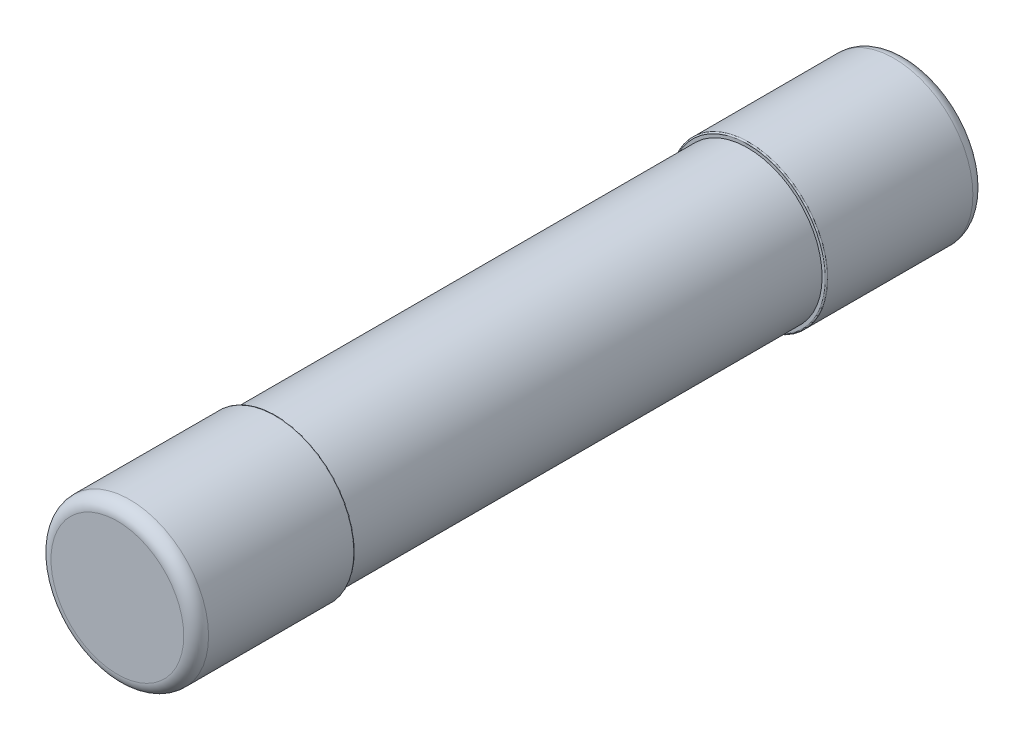
ISO-10303-21;
HEADER;
FILE_DESCRIPTION(('STEP AP214'),'2;1');
FILE_NAME('part.step','',(''),(''),'','','');
FILE_SCHEMA(('AUTOMOTIVE_DESIGN { 1 0 10303 214 1 1 1 1 }'));
ENDSEC;
DATA;
#1=APPLICATION_CONTEXT('core data for automotive mechanical design processes');
#2=APPLICATION_PROTOCOL_DEFINITION('international standard','automotive_design',2000,#1);
#3=PRODUCT_CONTEXT('',#1,'mechanical');
#4=PRODUCT('Part','Part','',(#3));
#5=PRODUCT_RELATED_PRODUCT_CATEGORY('part','',(#4));
#6=PRODUCT_DEFINITION_FORMATION('','',#4);
#7=PRODUCT_DEFINITION_CONTEXT('part definition',#1,'design');
#8=PRODUCT_DEFINITION('design','',#6,#7);
#9=PRODUCT_DEFINITION_SHAPE('','',#8);
#10=(LENGTH_UNIT() NAMED_UNIT(*) SI_UNIT(.MILLI.,.METRE.));
#11=(NAMED_UNIT(*) PLANE_ANGLE_UNIT() SI_UNIT($,.RADIAN.));
#12=(NAMED_UNIT(*) SI_UNIT($,.STERADIAN.) SOLID_ANGLE_UNIT());
#13=UNCERTAINTY_MEASURE_WITH_UNIT(LENGTH_MEASURE(1.E-05),#10,'distance_accuracy_value','');
#14=(GEOMETRIC_REPRESENTATION_CONTEXT(3) GLOBAL_UNCERTAINTY_ASSIGNED_CONTEXT((#13)) GLOBAL_UNIT_ASSIGNED_CONTEXT((#10,
#11,#12)) REPRESENTATION_CONTEXT('',''));
#15=CARTESIAN_POINT('',(0.,0.,0.));
#16=DIRECTION('',(0.,0.,1.));
#17=DIRECTION('',(1.,0.,0.));
#18=AXIS2_PLACEMENT_3D('',#15,#16,#17);
#19=CARTESIAN_POINT('',(0.,0.,-15.9));
#20=DIRECTION('',(0.,0.,-1.));
#21=DIRECTION('',(-1.,0.,0.));
#22=AXIS2_PLACEMENT_3D('',#19,#20,#21);
#23=PLANE('',#22);
#24=CARTESIAN_POINT('',(0.,0.,-15.9));
#25=DIRECTION('',(0.,0.,1.));
#26=DIRECTION('',(1.,0.,0.));
#27=AXIS2_PLACEMENT_3D('',#24,#25,#26);
#28=CIRCLE('',#27,2.675);
#29=CARTESIAN_POINT('',(2.675,0.,-15.9));
#30=VERTEX_POINT('',#29);
#31=EDGE_CURVE('E79',#30,#30,#28,.T.);
#32=ORIENTED_EDGE('',*,*,#31,.F.);
#33=EDGE_LOOP('',(#32));
#34=FACE_BOUND('',#33,.T.);
#35=ADVANCED_FACE('F14',(#34),#23,.T.);
#36=CARTESIAN_POINT('',(0.,0.,15.9));
#37=DIRECTION('',(0.,0.,-1.));
#38=DIRECTION('',(-1.,0.,0.));
#39=AXIS2_PLACEMENT_3D('',#36,#37,#38);
#40=PLANE('',#39);
#41=CARTESIAN_POINT('',(0.,0.,15.9));
#42=DIRECTION('',(0.,0.,-1.));
#43=DIRECTION('',(1.,0.,0.));
#44=AXIS2_PLACEMENT_3D('',#41,#42,#43);
#45=CIRCLE('',#44,2.675);
#46=CARTESIAN_POINT('',(2.675,0.,15.9));
#47=VERTEX_POINT('',#46);
#48=EDGE_CURVE('E58',#47,#47,#45,.T.);
#49=ORIENTED_EDGE('',*,*,#48,.F.);
#50=EDGE_LOOP('',(#49));
#51=FACE_BOUND('',#50,.T.);
#52=ADVANCED_FACE('F44',(#51),#40,.F.);
#53=CARTESIAN_POINT('',(0.,0.,-15.4));
#54=DIRECTION('',(0.,0.,-1.));
#55=DIRECTION('',(-1.,0.,0.));
#56=AXIS2_PLACEMENT_3D('',#53,#54,#55);
#57=TOROIDAL_SURFACE('',#56,2.675,0.5);
#58=ORIENTED_EDGE('',*,*,#31,.T.);
#59=EDGE_LOOP('',(#58));
#60=FACE_BOUND('',#59,.T.);
#61=CARTESIAN_POINT('',(0.,0.,-15.4));
#62=DIRECTION('',(0.,0.,1.));
#63=DIRECTION('',(1.,0.,0.));
#64=AXIS2_PLACEMENT_3D('',#61,#62,#63);
#65=CIRCLE('',#64,3.175);
#66=CARTESIAN_POINT('',(3.175,0.,-15.4));
#67=VERTEX_POINT('',#66);
#68=EDGE_CURVE('E87',#67,#67,#65,.T.);
#69=ORIENTED_EDGE('',*,*,#68,.F.);
#70=EDGE_LOOP('',(#69));
#71=FACE_BOUND('',#70,.T.);
#72=ADVANCED_FACE('F33',(#60,#71),#57,.T.);
#73=CARTESIAN_POINT('',(0.,0.,15.4));
#74=DIRECTION('',(0.,0.,-1.));
#75=DIRECTION('',(-1.,0.,0.));
#76=AXIS2_PLACEMENT_3D('',#73,#74,#75);
#77=TOROIDAL_SURFACE('',#76,2.675,0.5);
#78=CARTESIAN_POINT('',(0.,0.,15.4));
#79=DIRECTION('',(0.,0.,1.));
#80=DIRECTION('',(1.,0.,0.));
#81=AXIS2_PLACEMENT_3D('',#78,#79,#80);
#82=CIRCLE('',#81,3.175);
#83=CARTESIAN_POINT('',(3.175,0.,15.4));
#84=VERTEX_POINT('',#83);
#85=EDGE_CURVE('E89',#84,#84,#82,.F.);
#86=ORIENTED_EDGE('',*,*,#85,.F.);
#87=EDGE_LOOP('',(#86));
#88=FACE_BOUND('',#87,.T.);
#89=ORIENTED_EDGE('',*,*,#48,.T.);
#90=EDGE_LOOP('',(#89));
#91=FACE_BOUND('',#90,.T.);
#92=ADVANCED_FACE('F43',(#88,#91),#77,.T.);
#93=CARTESIAN_POINT('',(0.,0.,-9.5));
#94=DIRECTION('',(0.,0.,1.));
#95=DIRECTION('',(1.,0.,0.));
#96=AXIS2_PLACEMENT_3D('',#93,#94,#95);
#97=CYLINDRICAL_SURFACE('',#96,3.175);
#98=CARTESIAN_POINT('',(0.,0.,-9.55));
#99=DIRECTION('',(0.,0.,-1.));
#100=DIRECTION('',(-1.,0.,0.));
#101=AXIS2_PLACEMENT_3D('',#98,#99,#100);
#102=CIRCLE('',#101,3.175);
#103=CARTESIAN_POINT('',(-3.175,0.,-9.55));
#104=VERTEX_POINT('',#103);
#105=EDGE_CURVE('E94',#104,#104,#102,.F.);
#106=ORIENTED_EDGE('',*,*,#105,.F.);
#107=EDGE_LOOP('',(#106));
#108=FACE_BOUND('',#107,.T.);
#109=ORIENTED_EDGE('',*,*,#68,.T.);
#110=EDGE_LOOP('',(#109));
#111=FACE_BOUND('',#110,.T.);
#112=ADVANCED_FACE('F219',(#108,#111),#97,.T.);
#113=CARTESIAN_POINT('',(0.,0.,9.5));
#114=DIRECTION('',(0.,0.,1.));
#115=DIRECTION('',(1.,0.,0.));
#116=AXIS2_PLACEMENT_3D('',#113,#114,#115);
#117=CYLINDRICAL_SURFACE('',#116,3.175);
#118=CARTESIAN_POINT('',(0.,0.,9.55));
#119=DIRECTION('',(0.,0.,-1.));
#120=DIRECTION('',(-1.,0.,0.));
#121=AXIS2_PLACEMENT_3D('',#118,#119,#120);
#122=CIRCLE('',#121,3.175);
#123=CARTESIAN_POINT('',(-3.175,0.,9.55));
#124=VERTEX_POINT('',#123);
#125=EDGE_CURVE('E130',#124,#124,#122,.T.);
#126=ORIENTED_EDGE('',*,*,#125,.F.);
#127=EDGE_LOOP('',(#126));
#128=FACE_BOUND('',#127,.T.);
#129=ORIENTED_EDGE('',*,*,#85,.T.);
#130=EDGE_LOOP('',(#129));
#131=FACE_BOUND('',#130,.T.);
#132=ADVANCED_FACE('F118',(#128,#131),#117,.T.);
#133=CARTESIAN_POINT('',(0.,0.,-9.55));
#134=DIRECTION('',(0.,0.,-1.));
#135=DIRECTION('',(-1.,0.,0.));
#136=AXIS2_PLACEMENT_3D('',#133,#134,#135);
#137=TOROIDAL_SURFACE('',#136,3.125,0.05);
#138=ORIENTED_EDGE('',*,*,#105,.T.);
#139=EDGE_LOOP('',(#138));
#140=FACE_BOUND('',#139,.T.);
#141=CARTESIAN_POINT('',(0.,0.,-9.5));
#142=DIRECTION('',(0.,0.,-1.));
#143=DIRECTION('',(1.,0.,0.));
#144=AXIS2_PLACEMENT_3D('',#141,#142,#143);
#145=CIRCLE('',#144,3.125);
#146=CARTESIAN_POINT('',(3.125,0.,-9.5));
#147=VERTEX_POINT('',#146);
#148=EDGE_CURVE('E134',#147,#147,#145,.T.);
#149=ORIENTED_EDGE('',*,*,#148,.T.);
#150=EDGE_LOOP('',(#149));
#151=FACE_BOUND('',#150,.T.);
#152=ADVANCED_FACE('F106',(#140,#151),#137,.T.);
#153=CARTESIAN_POINT('',(0.,0.,9.55));
#154=DIRECTION('',(0.,0.,-1.));
#155=DIRECTION('',(-1.,0.,0.));
#156=AXIS2_PLACEMENT_3D('',#153,#154,#155);
#157=TOROIDAL_SURFACE('',#156,3.125,0.05);
#158=CARTESIAN_POINT('',(0.,0.,9.5));
#159=DIRECTION('',(0.,0.,1.));
#160=DIRECTION('',(1.,0.,0.));
#161=AXIS2_PLACEMENT_3D('',#158,#159,#160);
#162=CIRCLE('',#161,3.125);
#163=CARTESIAN_POINT('',(3.125,0.,9.5));
#164=VERTEX_POINT('',#163);
#165=EDGE_CURVE('E25',#164,#164,#162,.F.);
#166=ORIENTED_EDGE('',*,*,#165,.F.);
#167=EDGE_LOOP('',(#166));
#168=FACE_BOUND('',#167,.T.);
#169=ORIENTED_EDGE('',*,*,#125,.T.);
#170=EDGE_LOOP('',(#169));
#171=FACE_BOUND('',#170,.T.);
#172=ADVANCED_FACE('F117',(#168,#171),#157,.T.);
#173=CARTESIAN_POINT('',(0.,0.,-9.5));
#174=DIRECTION('',(0.,0.,-1.));
#175=DIRECTION('',(-1.,0.,0.));
#176=AXIS2_PLACEMENT_3D('',#173,#174,#175);
#177=PLANE('',#176);
#178=CARTESIAN_POINT('',(0.,0.,-9.5));
#179=DIRECTION('',(0.,0.,1.));
#180=DIRECTION('',(1.,0.,0.));
#181=AXIS2_PLACEMENT_3D('',#178,#179,#180);
#182=CIRCLE('',#181,3.);
#183=CARTESIAN_POINT('',(3.,0.,-9.5));
#184=VERTEX_POINT('',#183);
#185=EDGE_CURVE('E18',#184,#184,#182,.T.);
#186=ORIENTED_EDGE('',*,*,#185,.F.);
#187=EDGE_LOOP('',(#186));
#188=FACE_BOUND('',#187,.T.);
#189=ORIENTED_EDGE('',*,*,#148,.F.);
#190=EDGE_LOOP('',(#189));
#191=FACE_BOUND('',#190,.T.);
#192=ADVANCED_FACE('F163',(#188,#191),#177,.F.);
#193=CARTESIAN_POINT('',(0.,0.,9.5));
#194=DIRECTION('',(0.,0.,-1.));
#195=DIRECTION('',(-1.,0.,0.));
#196=AXIS2_PLACEMENT_3D('',#193,#194,#195);
#197=PLANE('',#196);
#198=CARTESIAN_POINT('',(0.,0.,9.5));
#199=DIRECTION('',(0.,0.,1.));
#200=DIRECTION('',(1.,0.,0.));
#201=AXIS2_PLACEMENT_3D('',#198,#199,#200);
#202=CIRCLE('',#201,3.);
#203=CARTESIAN_POINT('',(3.,0.,9.5));
#204=VERTEX_POINT('',#203);
#205=EDGE_CURVE('E9',#204,#204,#202,.F.);
#206=ORIENTED_EDGE('',*,*,#205,.F.);
#207=EDGE_LOOP('',(#206));
#208=FACE_BOUND('',#207,.T.);
#209=ORIENTED_EDGE('',*,*,#165,.T.);
#210=EDGE_LOOP('',(#209));
#211=FACE_BOUND('',#210,.T.);
#212=ADVANCED_FACE('F147',(#208,#211),#197,.T.);
#213=CARTESIAN_POINT('',(0.,0.,0.));
#214=DIRECTION('',(0.,0.,1.));
#215=DIRECTION('',(1.,0.,0.));
#216=AXIS2_PLACEMENT_3D('',#213,#214,#215);
#217=CYLINDRICAL_SURFACE('',#216,3.);
#218=ORIENTED_EDGE('',*,*,#205,.T.);
#219=EDGE_LOOP('',(#218));
#220=FACE_BOUND('',#219,.T.);
#221=ORIENTED_EDGE('',*,*,#185,.T.);
#222=EDGE_LOOP('',(#221));
#223=FACE_BOUND('',#222,.T.);
#224=ADVANCED_FACE('F162',(#220,#223),#217,.T.);
#225=CLOSED_SHELL('',(#35,#52,#72,#92,#112,#132,#152,#172,#192,#212,#224));
#226=MANIFOLD_SOLID_BREP('B1',#225);
#227=ADVANCED_BREP_SHAPE_REPRESENTATION('',(#18,#226),#14);
#228=SHAPE_DEFINITION_REPRESENTATION(#9,#227);
ENDSEC;
END-ISO-10303-21;
